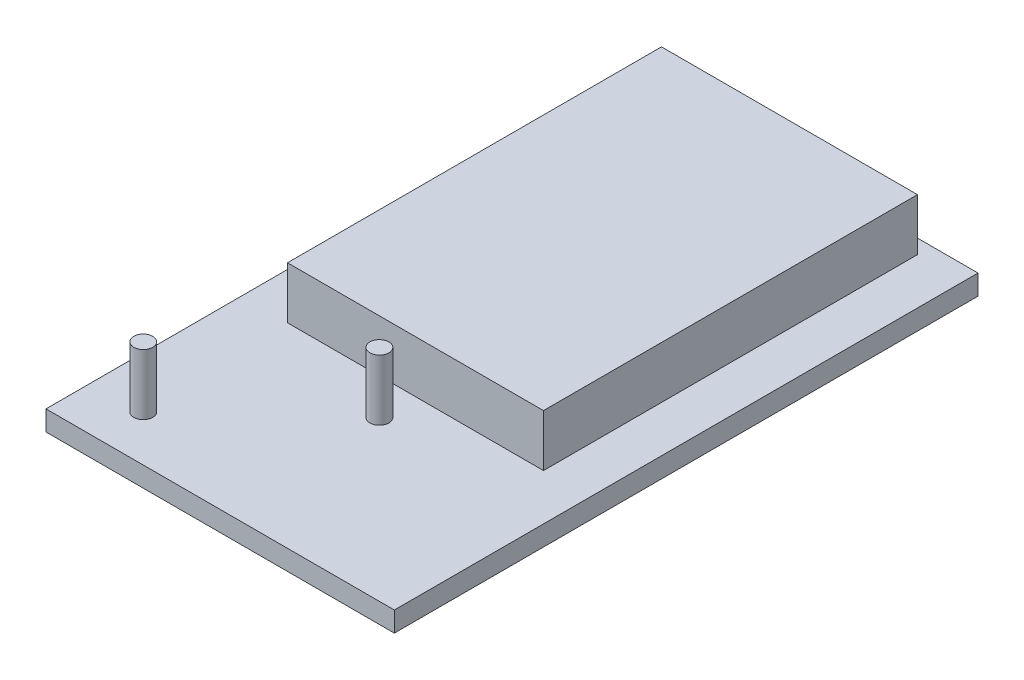
ISO-10303-21;
HEADER;
FILE_DESCRIPTION(('STEP AP214'),'2;1');
FILE_NAME('part.step','',(''),(''),'','','');
FILE_SCHEMA(('AUTOMOTIVE_DESIGN { 1 0 10303 214 1 1 1 1 }'));
ENDSEC;
DATA;
#1=APPLICATION_CONTEXT('core data for automotive mechanical design processes');
#2=APPLICATION_PROTOCOL_DEFINITION('international standard','automotive_design',2000,#1);
#3=PRODUCT_CONTEXT('',#1,'mechanical');
#4=PRODUCT('Part','Part','',(#3));
#5=PRODUCT_RELATED_PRODUCT_CATEGORY('part','',(#4));
#6=PRODUCT_DEFINITION_FORMATION('','',#4);
#7=PRODUCT_DEFINITION_CONTEXT('part definition',#1,'design');
#8=PRODUCT_DEFINITION('design','',#6,#7);
#9=PRODUCT_DEFINITION_SHAPE('','',#8);
#10=(LENGTH_UNIT() NAMED_UNIT(*) SI_UNIT(.MILLI.,.METRE.));
#11=(NAMED_UNIT(*) PLANE_ANGLE_UNIT() SI_UNIT($,.RADIAN.));
#12=(NAMED_UNIT(*) SI_UNIT($,.STERADIAN.) SOLID_ANGLE_UNIT());
#13=UNCERTAINTY_MEASURE_WITH_UNIT(LENGTH_MEASURE(1.E-05),#10,'distance_accuracy_value','');
#14=(GEOMETRIC_REPRESENTATION_CONTEXT(3) GLOBAL_UNCERTAINTY_ASSIGNED_CONTEXT((#13)) GLOBAL_UNIT_ASSIGNED_CONTEXT((#10,
#11,#12)) REPRESENTATION_CONTEXT('',''));
#15=CARTESIAN_POINT('',(0.,0.,0.));
#16=DIRECTION('',(0.,0.,1.));
#17=DIRECTION('',(1.,0.,0.));
#18=AXIS2_PLACEMENT_3D('',#15,#16,#17);
#19=CARTESIAN_POINT('',(-42.735,4.92,71.6));
#20=DIRECTION('',(1.,0.,0.));
#21=DIRECTION('',(0.,0.,-1.));
#22=AXIS2_PLACEMENT_3D('',#19,#20,#21);
#23=PLANE('',#22);
#24=DIRECTION('',(0.,0.,1.));
#25=VECTOR('',#24,1.);
#26=CARTESIAN_POINT('',(-42.735,0.,71.6));
#27=LINE('',#26,#25);
#28=CARTESIAN_POINT('',(-42.735,0.,-71.6));
#29=VERTEX_POINT('',#28);
#30=CARTESIAN_POINT('',(-42.735,0.,71.6));
#31=VERTEX_POINT('',#30);
#32=EDGE_CURVE('E130',#29,#31,#27,.T.);
#33=ORIENTED_EDGE('',*,*,#32,.T.);
#34=DIRECTION('',(0.,-1.,0.));
#35=VECTOR('',#34,1.);
#36=CARTESIAN_POINT('',(-42.735,4.92,71.6));
#37=LINE('',#36,#35);
#38=CARTESIAN_POINT('',(-42.735,4.92,71.6));
#39=VERTEX_POINT('',#38);
#40=EDGE_CURVE('E11',#39,#31,#37,.T.);
#41=ORIENTED_EDGE('',*,*,#40,.F.);
#42=DIRECTION('',(0.,0.,1.));
#43=VECTOR('',#42,1.);
#44=CARTESIAN_POINT('',(-42.735,4.92,71.6));
#45=LINE('',#44,#43);
#46=CARTESIAN_POINT('',(-42.735,4.92,-71.6));
#47=VERTEX_POINT('',#46);
#48=EDGE_CURVE('E141',#47,#39,#45,.T.);
#49=ORIENTED_EDGE('',*,*,#48,.F.);
#50=DIRECTION('',(0.,-1.,0.));
#51=VECTOR('',#50,1.);
#52=CARTESIAN_POINT('',(-42.735,4.92,-71.6));
#53=LINE('',#52,#51);
#54=EDGE_CURVE('E154',#47,#29,#53,.T.);
#55=ORIENTED_EDGE('',*,*,#54,.T.);
#56=EDGE_LOOP('',(#33,#41,#49,#55));
#57=FACE_BOUND('',#56,.T.);
#58=ADVANCED_FACE('F42',(#57),#23,.F.);
#59=CARTESIAN_POINT('',(42.735,4.92,71.6));
#60=DIRECTION('',(0.,0.,-1.));
#61=DIRECTION('',(-1.,0.,0.));
#62=AXIS2_PLACEMENT_3D('',#59,#60,#61);
#63=PLANE('',#62);
#64=DIRECTION('',(1.,0.,0.));
#65=VECTOR('',#64,1.);
#66=CARTESIAN_POINT('',(42.735,0.,71.6));
#67=LINE('',#66,#65);
#68=CARTESIAN_POINT('',(42.735,0.,71.6));
#69=VERTEX_POINT('',#68);
#70=EDGE_CURVE('E135',#31,#69,#67,.T.);
#71=ORIENTED_EDGE('',*,*,#70,.T.);
#72=DIRECTION('',(0.,-1.,0.));
#73=VECTOR('',#72,1.);
#74=CARTESIAN_POINT('',(42.735,4.92,71.6));
#75=LINE('',#74,#73);
#76=CARTESIAN_POINT('',(42.735,4.92,71.6));
#77=VERTEX_POINT('',#76);
#78=EDGE_CURVE('E50',#77,#69,#75,.T.);
#79=ORIENTED_EDGE('',*,*,#78,.F.);
#80=DIRECTION('',(1.,0.,0.));
#81=VECTOR('',#80,1.);
#82=CARTESIAN_POINT('',(42.735,4.92,71.6));
#83=LINE('',#82,#81);
#84=EDGE_CURVE('E145',#39,#77,#83,.T.);
#85=ORIENTED_EDGE('',*,*,#84,.F.);
#86=ORIENTED_EDGE('',*,*,#40,.T.);
#87=EDGE_LOOP('',(#71,#79,#85,#86));
#88=FACE_BOUND('',#87,.T.);
#89=ADVANCED_FACE('F191',(#88),#63,.F.);
#90=CARTESIAN_POINT('',(42.735,4.92,71.6));
#91=DIRECTION('',(-1.,0.,0.));
#92=DIRECTION('',(0.,0.,1.));
#93=AXIS2_PLACEMENT_3D('',#90,#91,#92);
#94=PLANE('',#93);
#95=DIRECTION('',(0.,0.,-1.));
#96=VECTOR('',#95,1.);
#97=CARTESIAN_POINT('',(42.735,0.,71.6));
#98=LINE('',#97,#96);
#99=CARTESIAN_POINT('',(42.735,0.,-71.6));
#100=VERTEX_POINT('',#99);
#101=EDGE_CURVE('E158',#69,#100,#98,.T.);
#102=ORIENTED_EDGE('',*,*,#101,.T.);
#103=DIRECTION('',(0.,-1.,0.));
#104=VECTOR('',#103,1.);
#105=CARTESIAN_POINT('',(42.735,4.92,-71.6));
#106=LINE('',#105,#104);
#107=CARTESIAN_POINT('',(42.735,4.92,-71.6));
#108=VERTEX_POINT('',#107);
#109=EDGE_CURVE('E166',#108,#100,#106,.T.);
#110=ORIENTED_EDGE('',*,*,#109,.F.);
#111=DIRECTION('',(0.,0.,-1.));
#112=VECTOR('',#111,1.);
#113=CARTESIAN_POINT('',(42.735,4.92,71.6));
#114=LINE('',#113,#112);
#115=EDGE_CURVE('E149',#77,#108,#114,.T.);
#116=ORIENTED_EDGE('',*,*,#115,.F.);
#117=ORIENTED_EDGE('',*,*,#78,.T.);
#118=EDGE_LOOP('',(#102,#110,#116,#117));
#119=FACE_BOUND('',#118,.T.);
#120=ADVANCED_FACE('F175',(#119),#94,.F.);
#121=CARTESIAN_POINT('',(42.735,4.92,-71.6));
#122=DIRECTION('',(0.,0.,1.));
#123=DIRECTION('',(1.,0.,0.));
#124=AXIS2_PLACEMENT_3D('',#121,#122,#123);
#125=PLANE('',#124);
#126=DIRECTION('',(-1.,0.,0.));
#127=VECTOR('',#126,1.);
#128=CARTESIAN_POINT('',(42.735,0.,-71.6));
#129=LINE('',#128,#127);
#130=EDGE_CURVE('E146',#100,#29,#129,.T.);
#131=ORIENTED_EDGE('',*,*,#130,.T.);
#132=ORIENTED_EDGE('',*,*,#54,.F.);
#133=DIRECTION('',(-1.,0.,0.));
#134=VECTOR('',#133,1.);
#135=CARTESIAN_POINT('',(42.735,4.92,-71.6));
#136=LINE('',#135,#134);
#137=EDGE_CURVE('E152',#108,#47,#136,.T.);
#138=ORIENTED_EDGE('',*,*,#137,.F.);
#139=ORIENTED_EDGE('',*,*,#109,.T.);
#140=EDGE_LOOP('',(#131,#132,#138,#139));
#141=FACE_BOUND('',#140,.T.);
#142=ADVANCED_FACE('F184',(#141),#125,.F.);
#143=CARTESIAN_POINT('',(0.,4.92,0.));
#144=DIRECTION('',(0.,1.,0.));
#145=DIRECTION('',(0.,0.,1.));
#146=AXIS2_PLACEMENT_3D('',#143,#144,#145);
#147=PLANE('',#146);
#148=CARTESIAN_POINT('',(-30.1569160384794,4.92,60.3139354349787));
#149=DIRECTION('',(0.,1.,0.));
#150=DIRECTION('',(0.,0.,1.));
#151=AXIS2_PLACEMENT_3D('',#148,#149,#150);
#152=CIRCLE('',#151,2.33);
#153=CARTESIAN_POINT('',(-30.1569160384794,4.92,62.6439354349787));
#154=VERTEX_POINT('',#153);
#155=EDGE_CURVE('E243',#154,#154,#152,.T.);
#156=ORIENTED_EDGE('',*,*,#155,.F.);
#157=EDGE_LOOP('',(#156));
#158=FACE_BOUND('',#157,.T.);
#159=CARTESIAN_POINT('',(0.,4.92,32.53));
#160=DIRECTION('',(0.,1.,0.));
#161=DIRECTION('',(0.,0.,1.));
#162=AXIS2_PLACEMENT_3D('',#159,#160,#161);
#163=CIRCLE('',#162,2.33);
#164=CARTESIAN_POINT('',(0.,4.92,34.86));
#165=VERTEX_POINT('',#164);
#166=EDGE_CURVE('E245',#165,#165,#163,.T.);
#167=ORIENTED_EDGE('',*,*,#166,.F.);
#168=EDGE_LOOP('',(#167));
#169=FACE_BOUND('',#168,.T.);
#170=DIRECTION('',(0.,0.,-1.));
#171=VECTOR('',#170,1.);
#172=CARTESIAN_POINT('',(31.405,4.92,-68.08));
#173=LINE('',#172,#171);
#174=CARTESIAN_POINT('',(31.405,4.92,23.68));
#175=VERTEX_POINT('',#174);
#176=CARTESIAN_POINT('',(31.405,4.92,-68.08));
#177=VERTEX_POINT('',#176);
#178=EDGE_CURVE('E57',#175,#177,#173,.T.);
#179=ORIENTED_EDGE('',*,*,#178,.F.);
#180=DIRECTION('',(1.,0.,0.));
#181=VECTOR('',#180,1.);
#182=CARTESIAN_POINT('',(-31.405,4.92,23.68));
#183=LINE('',#182,#181);
#184=CARTESIAN_POINT('',(-31.405,4.92,23.68));
#185=VERTEX_POINT('',#184);
#186=EDGE_CURVE('E61',#185,#175,#183,.T.);
#187=ORIENTED_EDGE('',*,*,#186,.F.);
#188=DIRECTION('',(0.,0.,1.));
#189=VECTOR('',#188,1.);
#190=CARTESIAN_POINT('',(-31.405,4.92,-68.08));
#191=LINE('',#190,#189);
#192=CARTESIAN_POINT('',(-31.405,4.92,-68.08));
#193=VERTEX_POINT('',#192);
#194=EDGE_CURVE('E267',#193,#185,#191,.T.);
#195=ORIENTED_EDGE('',*,*,#194,.F.);
#196=DIRECTION('',(-1.,0.,0.));
#197=VECTOR('',#196,1.);
#198=CARTESIAN_POINT('',(-31.405,4.92,-68.08));
#199=LINE('',#198,#197);
#200=EDGE_CURVE('E264',#177,#193,#199,.T.);
#201=ORIENTED_EDGE('',*,*,#200,.F.);
#202=EDGE_LOOP('',(#179,#187,#195,#201));
#203=FACE_BOUND('',#202,.T.);
#204=ORIENTED_EDGE('',*,*,#48,.T.);
#205=ORIENTED_EDGE('',*,*,#84,.T.);
#206=ORIENTED_EDGE('',*,*,#115,.T.);
#207=ORIENTED_EDGE('',*,*,#137,.T.);
#208=EDGE_LOOP('',(#204,#205,#206,#207));
#209=FACE_BOUND('',#208,.T.);
#210=ADVANCED_FACE('F190',(#158,#169,#203,#209),#147,.T.);
#211=CARTESIAN_POINT('',(0.,0.,0.));
#212=DIRECTION('',(0.,1.,0.));
#213=DIRECTION('',(0.,0.,1.));
#214=AXIS2_PLACEMENT_3D('',#211,#212,#213);
#215=PLANE('',#214);
#216=ORIENTED_EDGE('',*,*,#32,.F.);
#217=ORIENTED_EDGE('',*,*,#130,.F.);
#218=ORIENTED_EDGE('',*,*,#101,.F.);
#219=ORIENTED_EDGE('',*,*,#70,.F.);
#220=EDGE_LOOP('',(#216,#217,#218,#219));
#221=FACE_BOUND('',#220,.T.);
#222=ADVANCED_FACE('F181',(#221),#215,.F.);
#223=CARTESIAN_POINT('',(31.405,17.67,-68.08));
#224=DIRECTION('',(-1.,0.,0.));
#225=DIRECTION('',(0.,0.,1.));
#226=AXIS2_PLACEMENT_3D('',#223,#224,#225);
#227=PLANE('',#226);
#228=ORIENTED_EDGE('',*,*,#178,.T.);
#229=DIRECTION('',(0.,-1.,0.));
#230=VECTOR('',#229,1.);
#231=CARTESIAN_POINT('',(31.405,17.67,-68.08));
#232=LINE('',#231,#230);
#233=CARTESIAN_POINT('',(31.405,17.67,-68.08));
#234=VERTEX_POINT('',#233);
#235=EDGE_CURVE('E110',#234,#177,#232,.T.);
#236=ORIENTED_EDGE('',*,*,#235,.F.);
#237=DIRECTION('',(0.,0.,-1.));
#238=VECTOR('',#237,1.);
#239=CARTESIAN_POINT('',(31.405,17.67,-68.08));
#240=LINE('',#239,#238);
#241=CARTESIAN_POINT('',(31.405,17.67,23.68));
#242=VERTEX_POINT('',#241);
#243=EDGE_CURVE('E117',#242,#234,#240,.T.);
#244=ORIENTED_EDGE('',*,*,#243,.F.);
#245=DIRECTION('',(0.,-1.,0.));
#246=VECTOR('',#245,1.);
#247=CARTESIAN_POINT('',(31.405,17.67,23.68));
#248=LINE('',#247,#246);
#249=EDGE_CURVE('E261',#242,#175,#248,.T.);
#250=ORIENTED_EDGE('',*,*,#249,.T.);
#251=EDGE_LOOP('',(#228,#236,#244,#250));
#252=FACE_BOUND('',#251,.T.);
#253=ADVANCED_FACE('F128',(#252),#227,.F.);
#254=CARTESIAN_POINT('',(-31.405,17.67,-68.08));
#255=DIRECTION('',(0.,0.,1.));
#256=DIRECTION('',(1.,0.,0.));
#257=AXIS2_PLACEMENT_3D('',#254,#255,#256);
#258=PLANE('',#257);
#259=ORIENTED_EDGE('',*,*,#200,.T.);
#260=DIRECTION('',(0.,-1.,0.));
#261=VECTOR('',#260,1.);
#262=CARTESIAN_POINT('',(-31.405,17.67,-68.08));
#263=LINE('',#262,#261);
#264=CARTESIAN_POINT('',(-31.405,17.67,-68.08));
#265=VERTEX_POINT('',#264);
#266=EDGE_CURVE('E112',#265,#193,#263,.T.);
#267=ORIENTED_EDGE('',*,*,#266,.F.);
#268=DIRECTION('',(-1.,0.,0.));
#269=VECTOR('',#268,1.);
#270=CARTESIAN_POINT('',(-31.405,17.67,-68.08));
#271=LINE('',#270,#269);
#272=EDGE_CURVE('E105',#234,#265,#271,.T.);
#273=ORIENTED_EDGE('',*,*,#272,.F.);
#274=ORIENTED_EDGE('',*,*,#235,.T.);
#275=EDGE_LOOP('',(#259,#267,#273,#274));
#276=FACE_BOUND('',#275,.T.);
#277=ADVANCED_FACE('F108',(#276),#258,.F.);
#278=CARTESIAN_POINT('',(-31.405,17.67,-68.08));
#279=DIRECTION('',(1.,0.,0.));
#280=DIRECTION('',(0.,0.,-1.));
#281=AXIS2_PLACEMENT_3D('',#278,#279,#280);
#282=PLANE('',#281);
#283=ORIENTED_EDGE('',*,*,#194,.T.);
#284=DIRECTION('',(0.,-1.,0.));
#285=VECTOR('',#284,1.);
#286=CARTESIAN_POINT('',(-31.405,17.67,23.68));
#287=LINE('',#286,#285);
#288=CARTESIAN_POINT('',(-31.405,17.67,23.68));
#289=VERTEX_POINT('',#288);
#290=EDGE_CURVE('E137',#289,#185,#287,.T.);
#291=ORIENTED_EDGE('',*,*,#290,.F.);
#292=DIRECTION('',(0.,0.,1.));
#293=VECTOR('',#292,1.);
#294=CARTESIAN_POINT('',(-31.405,17.67,-68.08));
#295=LINE('',#294,#293);
#296=EDGE_CURVE('E116',#265,#289,#295,.T.);
#297=ORIENTED_EDGE('',*,*,#296,.F.);
#298=ORIENTED_EDGE('',*,*,#266,.T.);
#299=EDGE_LOOP('',(#283,#291,#297,#298));
#300=FACE_BOUND('',#299,.T.);
#301=ADVANCED_FACE('F210',(#300),#282,.F.);
#302=CARTESIAN_POINT('',(-31.405,17.67,23.68));
#303=DIRECTION('',(0.,0.,-1.));
#304=DIRECTION('',(-1.,0.,0.));
#305=AXIS2_PLACEMENT_3D('',#302,#303,#304);
#306=PLANE('',#305);
#307=ORIENTED_EDGE('',*,*,#186,.T.);
#308=ORIENTED_EDGE('',*,*,#249,.F.);
#309=DIRECTION('',(1.,0.,0.));
#310=VECTOR('',#309,1.);
#311=CARTESIAN_POINT('',(-31.405,17.67,23.68));
#312=LINE('',#311,#310);
#313=EDGE_CURVE('E122',#289,#242,#312,.T.);
#314=ORIENTED_EDGE('',*,*,#313,.F.);
#315=ORIENTED_EDGE('',*,*,#290,.T.);
#316=EDGE_LOOP('',(#307,#308,#314,#315));
#317=FACE_BOUND('',#316,.T.);
#318=ADVANCED_FACE('F213',(#317),#306,.F.);
#319=CARTESIAN_POINT('',(0.,17.67,0.));
#320=DIRECTION('',(0.,1.,0.));
#321=DIRECTION('',(0.,0.,1.));
#322=AXIS2_PLACEMENT_3D('',#319,#320,#321);
#323=PLANE('',#322);
#324=ORIENTED_EDGE('',*,*,#243,.T.);
#325=ORIENTED_EDGE('',*,*,#272,.T.);
#326=ORIENTED_EDGE('',*,*,#296,.T.);
#327=ORIENTED_EDGE('',*,*,#313,.T.);
#328=EDGE_LOOP('',(#324,#325,#326,#327));
#329=FACE_BOUND('',#328,.T.);
#330=ADVANCED_FACE('F120',(#329),#323,.T.);
#331=CARTESIAN_POINT('',(0.,19.82,32.53));
#332=DIRECTION('',(0.,-1.,0.));
#333=DIRECTION('',(0.,0.,-1.));
#334=AXIS2_PLACEMENT_3D('',#331,#332,#333);
#335=CYLINDRICAL_SURFACE('',#334,2.33);
#336=CARTESIAN_POINT('',(0.,19.82,32.53));
#337=DIRECTION('',(0.,1.,0.));
#338=DIRECTION('',(0.,0.,1.));
#339=AXIS2_PLACEMENT_3D('',#336,#337,#338);
#340=CIRCLE('',#339,2.33);
#341=CARTESIAN_POINT('',(0.,19.82,34.86));
#342=VERTEX_POINT('',#341);
#343=EDGE_CURVE('E250',#342,#342,#340,.T.);
#344=ORIENTED_EDGE('',*,*,#343,.F.);
#345=EDGE_LOOP('',(#344));
#346=FACE_BOUND('',#345,.T.);
#347=ORIENTED_EDGE('',*,*,#166,.T.);
#348=EDGE_LOOP('',(#347));
#349=FACE_BOUND('',#348,.T.);
#350=ADVANCED_FACE('F220',(#346,#349),#335,.T.);
#351=CARTESIAN_POINT('',(0.,19.82,32.53));
#352=DIRECTION('',(0.,1.,0.));
#353=DIRECTION('',(0.,0.,1.));
#354=AXIS2_PLACEMENT_3D('',#351,#352,#353);
#355=PLANE('',#354);
#356=ORIENTED_EDGE('',*,*,#343,.T.);
#357=EDGE_LOOP('',(#356));
#358=FACE_BOUND('',#357,.T.);
#359=ADVANCED_FACE('F223',(#358),#355,.T.);
#360=CARTESIAN_POINT('',(-30.1569160384794,19.82,60.3139354349787));
#361=DIRECTION('',(0.,-1.,0.));
#362=DIRECTION('',(0.,0.,-1.));
#363=AXIS2_PLACEMENT_3D('',#360,#361,#362);
#364=CYLINDRICAL_SURFACE('',#363,2.33);
#365=CARTESIAN_POINT('',(-30.1569160384794,19.82,60.3139354349787));
#366=DIRECTION('',(0.,1.,0.));
#367=DIRECTION('',(0.,0.,1.));
#368=AXIS2_PLACEMENT_3D('',#365,#366,#367);
#369=CIRCLE('',#368,2.33);
#370=CARTESIAN_POINT('',(-30.1569160384794,19.82,62.6439354349787));
#371=VERTEX_POINT('',#370);
#372=EDGE_CURVE('E240',#371,#371,#369,.T.);
#373=ORIENTED_EDGE('',*,*,#372,.F.);
#374=EDGE_LOOP('',(#373));
#375=FACE_BOUND('',#374,.T.);
#376=ORIENTED_EDGE('',*,*,#155,.T.);
#377=EDGE_LOOP('',(#376));
#378=FACE_BOUND('',#377,.T.);
#379=ADVANCED_FACE('F227',(#375,#378),#364,.T.);
#380=CARTESIAN_POINT('',(-30.1569160384794,19.82,60.3139354349787));
#381=DIRECTION('',(0.,1.,0.));
#382=DIRECTION('',(0.,0.,1.));
#383=AXIS2_PLACEMENT_3D('',#380,#381,#382);
#384=PLANE('',#383);
#385=ORIENTED_EDGE('',*,*,#372,.T.);
#386=EDGE_LOOP('',(#385));
#387=FACE_BOUND('',#386,.T.);
#388=ADVANCED_FACE('F229',(#387),#384,.T.);
#389=CLOSED_SHELL('',(#58,#89,#120,#142,#210,#222,#253,#277,#301,#318,#330,#350,#359,#379,#388));
#390=MANIFOLD_SOLID_BREP('B2',#389);
#391=ADVANCED_BREP_SHAPE_REPRESENTATION('',(#18,#390),#14);
#392=SHAPE_DEFINITION_REPRESENTATION(#9,#391);
ENDSEC;
END-ISO-10303-21;
